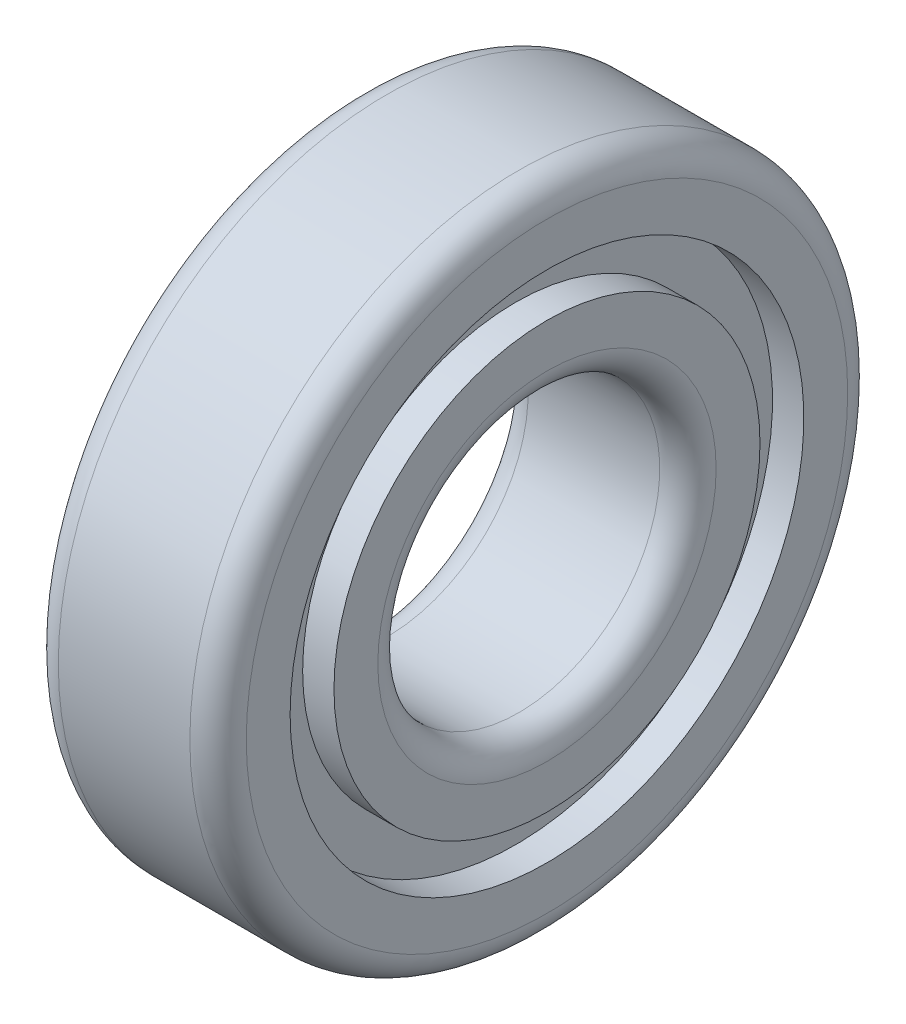
ISO-10303-21;
HEADER;
FILE_DESCRIPTION(('STEP AP214'),'2;1');
FILE_NAME('part.step','',(''),(''),'','','');
FILE_SCHEMA(('AUTOMOTIVE_DESIGN { 1 0 10303 214 1 1 1 1 }'));
ENDSEC;
DATA;
#1=APPLICATION_CONTEXT('core data for automotive mechanical design processes');
#2=APPLICATION_PROTOCOL_DEFINITION('international standard','automotive_design',2000,#1);
#3=PRODUCT_CONTEXT('',#1,'mechanical');
#4=PRODUCT('Part','Part','',(#3));
#5=PRODUCT_RELATED_PRODUCT_CATEGORY('part','',(#4));
#6=PRODUCT_DEFINITION_FORMATION('','',#4);
#7=PRODUCT_DEFINITION_CONTEXT('part definition',#1,'design');
#8=PRODUCT_DEFINITION('design','',#6,#7);
#9=PRODUCT_DEFINITION_SHAPE('','',#8);
#10=(LENGTH_UNIT() NAMED_UNIT(*) SI_UNIT(.MILLI.,.METRE.));
#11=(NAMED_UNIT(*) PLANE_ANGLE_UNIT() SI_UNIT($,.RADIAN.));
#12=(NAMED_UNIT(*) SI_UNIT($,.STERADIAN.) SOLID_ANGLE_UNIT());
#13=UNCERTAINTY_MEASURE_WITH_UNIT(LENGTH_MEASURE(1.E-05),#10,'distance_accuracy_value','');
#14=(GEOMETRIC_REPRESENTATION_CONTEXT(3) GLOBAL_UNCERTAINTY_ASSIGNED_CONTEXT((#13)) GLOBAL_UNIT_ASSIGNED_CONTEXT((#10,
#11,#12)) REPRESENTATION_CONTEXT('',''));
#15=CARTESIAN_POINT('',(0.,0.,0.));
#16=DIRECTION('',(0.,0.,1.));
#17=DIRECTION('',(1.,0.,0.));
#18=AXIS2_PLACEMENT_3D('',#15,#16,#17);
#19=CARTESIAN_POINT('',(-0.700000000000003,0.,0.));
#20=DIRECTION('',(-1.,0.,0.));
#21=DIRECTION('',(0.,0.,1.));
#22=AXIS2_PLACEMENT_3D('',#19,#20,#21);
#23=TOROIDAL_SURFACE('',#22,1.8,0.299999999999996);
#24=CARTESIAN_POINT('',(-0.700000000000034,0.,0.));
#25=DIRECTION('',(-1.,0.,0.));
#26=DIRECTION('',(0.,0.,1.));
#27=AXIS2_PLACEMENT_3D('',#24,#25,#26);
#28=CIRCLE('',#27,1.5);
#29=CARTESIAN_POINT('',(-0.700000000000034,0.,1.5));
#30=VERTEX_POINT('',#29);
#31=EDGE_CURVE('E83',#30,#30,#28,.T.);
#32=ORIENTED_EDGE('',*,*,#31,.F.);
#33=EDGE_LOOP('',(#32));
#34=FACE_BOUND('',#33,.T.);
#35=CARTESIAN_POINT('',(-1.,0.,0.));
#36=DIRECTION('',(-1.,0.,0.));
#37=DIRECTION('',(0.,0.,1.));
#38=AXIS2_PLACEMENT_3D('',#35,#36,#37);
#39=CIRCLE('',#38,1.8);
#40=CARTESIAN_POINT('',(-1.,0.,1.8));
#41=VERTEX_POINT('',#40);
#42=EDGE_CURVE('E10',#41,#41,#39,.T.);
#43=ORIENTED_EDGE('',*,*,#42,.T.);
#44=EDGE_LOOP('',(#43));
#45=FACE_BOUND('',#44,.T.);
#46=ADVANCED_FACE('F31',(#34,#45),#23,.T.);
#47=CARTESIAN_POINT('',(-1.,1.8,0.));
#48=DIRECTION('',(1.,0.,0.));
#49=DIRECTION('',(0.,0.,-1.));
#50=AXIS2_PLACEMENT_3D('',#47,#48,#49);
#51=PLANE('',#50);
#52=ORIENTED_EDGE('',*,*,#42,.F.);
#53=EDGE_LOOP('',(#52));
#54=FACE_BOUND('',#53,.T.);
#55=CARTESIAN_POINT('',(-1.,0.,0.));
#56=DIRECTION('',(-1.,0.,0.));
#57=DIRECTION('',(0.,0.,1.));
#58=AXIS2_PLACEMENT_3D('',#55,#56,#57);
#59=CIRCLE('',#58,2.26666666666667);
#60=CARTESIAN_POINT('',(-1.,0.,2.26666666666667));
#61=VERTEX_POINT('',#60);
#62=EDGE_CURVE('E37',#61,#61,#59,.T.);
#63=ORIENTED_EDGE('',*,*,#62,.T.);
#64=EDGE_LOOP('',(#63));
#65=FACE_BOUND('',#64,.T.);
#66=ADVANCED_FACE('F90',(#54,#65),#51,.F.);
#67=CARTESIAN_POINT('',(-1000.,0.,0.));
#68=DIRECTION('',(-1.,0.,0.));
#69=DIRECTION('',(0.,0.,1.));
#70=AXIS2_PLACEMENT_3D('',#67,#68,#69);
#71=CYLINDRICAL_SURFACE('',#70,2.26666666666667);
#72=ORIENTED_EDGE('',*,*,#62,.F.);
#73=EDGE_LOOP('',(#72));
#74=FACE_BOUND('',#73,.T.);
#75=CARTESIAN_POINT('',(-0.666666666666704,0.,0.));
#76=DIRECTION('',(-1.,0.,0.));
#77=DIRECTION('',(0.,0.,1.));
#78=AXIS2_PLACEMENT_3D('',#75,#76,#77);
#79=CIRCLE('',#78,2.26666666666667);
#80=CARTESIAN_POINT('',(-0.666666666666704,0.,2.26666666666667));
#81=VERTEX_POINT('',#80);
#82=EDGE_CURVE('E41',#81,#81,#79,.T.);
#83=ORIENTED_EDGE('',*,*,#82,.T.);
#84=EDGE_LOOP('',(#83));
#85=FACE_BOUND('',#84,.T.);
#86=ADVANCED_FACE('F94',(#74,#85),#71,.T.);
#87=CARTESIAN_POINT('',(-0.666666666666668,2.26666666666667,0.));
#88=DIRECTION('',(1.,0.,0.));
#89=DIRECTION('',(0.,0.,-1.));
#90=AXIS2_PLACEMENT_3D('',#87,#88,#89);
#91=PLANE('',#90);
#92=ORIENTED_EDGE('',*,*,#82,.F.);
#93=EDGE_LOOP('',(#92));
#94=FACE_BOUND('',#93,.T.);
#95=CARTESIAN_POINT('',(-0.666666666666704,0.,0.));
#96=DIRECTION('',(-1.,0.,0.));
#97=DIRECTION('',(0.,0.,1.));
#98=AXIS2_PLACEMENT_3D('',#95,#96,#97);
#99=CIRCLE('',#98,2.73333333333334);
#100=CARTESIAN_POINT('',(-0.666666666666704,0.,2.73333333333334));
#101=VERTEX_POINT('',#100);
#102=EDGE_CURVE('E45',#101,#101,#99,.T.);
#103=ORIENTED_EDGE('',*,*,#102,.T.);
#104=EDGE_LOOP('',(#103));
#105=FACE_BOUND('',#104,.T.);
#106=ADVANCED_FACE('F99',(#94,#105),#91,.F.);
#107=CARTESIAN_POINT('',(-1000.,0.,0.));
#108=DIRECTION('',(-1.,0.,0.));
#109=DIRECTION('',(0.,0.,1.));
#110=AXIS2_PLACEMENT_3D('',#107,#108,#109);
#111=CYLINDRICAL_SURFACE('',#110,2.73333333333334);
#112=ORIENTED_EDGE('',*,*,#102,.F.);
#113=EDGE_LOOP('',(#112));
#114=FACE_BOUND('',#113,.T.);
#115=CARTESIAN_POINT('',(-1.,0.,0.));
#116=DIRECTION('',(-1.,0.,0.));
#117=DIRECTION('',(0.,0.,1.));
#118=AXIS2_PLACEMENT_3D('',#115,#116,#117);
#119=CIRCLE('',#118,2.73333333333334);
#120=CARTESIAN_POINT('',(-1.,0.,2.73333333333334));
#121=VERTEX_POINT('',#120);
#122=EDGE_CURVE('E50',#121,#121,#119,.T.);
#123=ORIENTED_EDGE('',*,*,#122,.T.);
#124=EDGE_LOOP('',(#123));
#125=FACE_BOUND('',#124,.T.);
#126=ADVANCED_FACE('F105',(#114,#125),#111,.F.);
#127=CARTESIAN_POINT('',(-0.999999999999999,2.73333333333334,0.));
#128=DIRECTION('',(1.,0.,0.));
#129=DIRECTION('',(0.,0.,-1.));
#130=AXIS2_PLACEMENT_3D('',#127,#128,#129);
#131=PLANE('',#130);
#132=ORIENTED_EDGE('',*,*,#122,.F.);
#133=EDGE_LOOP('',(#132));
#134=FACE_BOUND('',#133,.T.);
#135=CARTESIAN_POINT('',(-1.,0.,0.));
#136=DIRECTION('',(-1.,0.,0.));
#137=DIRECTION('',(0.,0.,1.));
#138=AXIS2_PLACEMENT_3D('',#135,#136,#137);
#139=CIRCLE('',#138,3.19999999999999);
#140=CARTESIAN_POINT('',(-1.,0.,3.19999999999999));
#141=VERTEX_POINT('',#140);
#142=EDGE_CURVE('E53',#141,#141,#139,.T.);
#143=ORIENTED_EDGE('',*,*,#142,.T.);
#144=EDGE_LOOP('',(#143));
#145=FACE_BOUND('',#144,.T.);
#146=ADVANCED_FACE('F109',(#134,#145),#131,.F.);
#147=CARTESIAN_POINT('',(-0.699999999999999,0.,0.));
#148=DIRECTION('',(-1.,0.,0.));
#149=DIRECTION('',(0.,0.,1.));
#150=AXIS2_PLACEMENT_3D('',#147,#148,#149);
#151=TOROIDAL_SURFACE('',#150,3.20000000000001,0.299999999999998);
#152=ORIENTED_EDGE('',*,*,#142,.F.);
#153=EDGE_LOOP('',(#152));
#154=FACE_BOUND('',#153,.T.);
#155=CARTESIAN_POINT('',(-0.700000000000034,0.,0.));
#156=DIRECTION('',(-1.,0.,0.));
#157=DIRECTION('',(0.,0.,1.));
#158=AXIS2_PLACEMENT_3D('',#155,#156,#157);
#159=CIRCLE('',#158,3.5);
#160=CARTESIAN_POINT('',(-0.700000000000034,0.,3.5));
#161=VERTEX_POINT('',#160);
#162=EDGE_CURVE('E56',#161,#161,#159,.T.);
#163=ORIENTED_EDGE('',*,*,#162,.T.);
#164=EDGE_LOOP('',(#163));
#165=FACE_BOUND('',#164,.T.);
#166=ADVANCED_FACE('F113',(#154,#165),#151,.T.);
#167=CARTESIAN_POINT('',(-1000.,0.,0.));
#168=DIRECTION('',(-1.,0.,0.));
#169=DIRECTION('',(0.,0.,1.));
#170=AXIS2_PLACEMENT_3D('',#167,#168,#169);
#171=CYLINDRICAL_SURFACE('',#170,3.5);
#172=ORIENTED_EDGE('',*,*,#162,.F.);
#173=EDGE_LOOP('',(#172));
#174=FACE_BOUND('',#173,.T.);
#175=CARTESIAN_POINT('',(0.699999999999923,0.,0.));
#176=DIRECTION('',(-1.,0.,0.));
#177=DIRECTION('',(0.,0.,1.));
#178=AXIS2_PLACEMENT_3D('',#175,#176,#177);
#179=CIRCLE('',#178,3.50000000000001);
#180=CARTESIAN_POINT('',(0.699999999999923,0.,3.50000000000001));
#181=VERTEX_POINT('',#180);
#182=EDGE_CURVE('E59',#181,#181,#179,.T.);
#183=ORIENTED_EDGE('',*,*,#182,.T.);
#184=EDGE_LOOP('',(#183));
#185=FACE_BOUND('',#184,.T.);
#186=ADVANCED_FACE('F117',(#174,#185),#171,.T.);
#187=CARTESIAN_POINT('',(0.699999999999999,0.,0.));
#188=DIRECTION('',(-1.,0.,0.));
#189=DIRECTION('',(0.,0.,1.));
#190=AXIS2_PLACEMENT_3D('',#187,#188,#189);
#191=TOROIDAL_SURFACE('',#190,3.20000000000001,0.299999999999998);
#192=ORIENTED_EDGE('',*,*,#182,.F.);
#193=EDGE_LOOP('',(#192));
#194=FACE_BOUND('',#193,.T.);
#195=CARTESIAN_POINT('',(0.99999999999989,0.,0.));
#196=DIRECTION('',(-1.,0.,0.));
#197=DIRECTION('',(0.,0.,1.));
#198=AXIS2_PLACEMENT_3D('',#195,#196,#197);
#199=CIRCLE('',#198,3.19999999999999);
#200=CARTESIAN_POINT('',(0.99999999999989,0.,3.19999999999999));
#201=VERTEX_POINT('',#200);
#202=EDGE_CURVE('E62',#201,#201,#199,.T.);
#203=ORIENTED_EDGE('',*,*,#202,.T.);
#204=EDGE_LOOP('',(#203));
#205=FACE_BOUND('',#204,.T.);
#206=ADVANCED_FACE('F121',(#194,#205),#191,.T.);
#207=CARTESIAN_POINT('',(1.,2.73333333333334,0.));
#208=DIRECTION('',(-1.,0.,0.));
#209=DIRECTION('',(0.,0.,1.));
#210=AXIS2_PLACEMENT_3D('',#207,#208,#209);
#211=PLANE('',#210);
#212=ORIENTED_EDGE('',*,*,#202,.F.);
#213=EDGE_LOOP('',(#212));
#214=FACE_BOUND('',#213,.T.);
#215=CARTESIAN_POINT('',(0.99999999999989,0.,0.));
#216=DIRECTION('',(-1.,0.,0.));
#217=DIRECTION('',(0.,0.,1.));
#218=AXIS2_PLACEMENT_3D('',#215,#216,#217);
#219=CIRCLE('',#218,2.73333333333334);
#220=CARTESIAN_POINT('',(0.99999999999989,0.,2.73333333333334));
#221=VERTEX_POINT('',#220);
#222=EDGE_CURVE('E65',#221,#221,#219,.T.);
#223=ORIENTED_EDGE('',*,*,#222,.T.);
#224=EDGE_LOOP('',(#223));
#225=FACE_BOUND('',#224,.T.);
#226=ADVANCED_FACE('F125',(#214,#225),#211,.F.);
#227=CARTESIAN_POINT('',(-1000.,0.,0.));
#228=DIRECTION('',(-1.,0.,0.));
#229=DIRECTION('',(0.,0.,1.));
#230=AXIS2_PLACEMENT_3D('',#227,#228,#229);
#231=CYLINDRICAL_SURFACE('',#230,2.73333333333334);
#232=ORIENTED_EDGE('',*,*,#222,.F.);
#233=EDGE_LOOP('',(#232));
#234=FACE_BOUND('',#233,.T.);
#235=CARTESIAN_POINT('',(0.666666666666593,0.,0.));
#236=DIRECTION('',(-1.,0.,0.));
#237=DIRECTION('',(0.,0.,1.));
#238=AXIS2_PLACEMENT_3D('',#235,#236,#237);
#239=CIRCLE('',#238,2.73333333333334);
#240=CARTESIAN_POINT('',(0.666666666666593,0.,2.73333333333334));
#241=VERTEX_POINT('',#240);
#242=EDGE_CURVE('E68',#241,#241,#239,.T.);
#243=ORIENTED_EDGE('',*,*,#242,.T.);
#244=EDGE_LOOP('',(#243));
#245=FACE_BOUND('',#244,.T.);
#246=ADVANCED_FACE('F129',(#234,#245),#231,.F.);
#247=CARTESIAN_POINT('',(0.666666666666668,2.26666666666667,0.));
#248=DIRECTION('',(-1.,0.,0.));
#249=DIRECTION('',(0.,0.,1.));
#250=AXIS2_PLACEMENT_3D('',#247,#248,#249);
#251=PLANE('',#250);
#252=ORIENTED_EDGE('',*,*,#242,.F.);
#253=EDGE_LOOP('',(#252));
#254=FACE_BOUND('',#253,.T.);
#255=CARTESIAN_POINT('',(0.666666666666593,0.,0.));
#256=DIRECTION('',(-1.,0.,0.));
#257=DIRECTION('',(0.,0.,1.));
#258=AXIS2_PLACEMENT_3D('',#255,#256,#257);
#259=CIRCLE('',#258,2.26666666666667);
#260=CARTESIAN_POINT('',(0.666666666666593,0.,2.26666666666667));
#261=VERTEX_POINT('',#260);
#262=EDGE_CURVE('E71',#261,#261,#259,.T.);
#263=ORIENTED_EDGE('',*,*,#262,.T.);
#264=EDGE_LOOP('',(#263));
#265=FACE_BOUND('',#264,.T.);
#266=ADVANCED_FACE('F133',(#254,#265),#251,.F.);
#267=CARTESIAN_POINT('',(-1000.,0.,0.));
#268=DIRECTION('',(-1.,0.,0.));
#269=DIRECTION('',(0.,0.,1.));
#270=AXIS2_PLACEMENT_3D('',#267,#268,#269);
#271=CYLINDRICAL_SURFACE('',#270,2.26666666666667);
#272=ORIENTED_EDGE('',*,*,#262,.F.);
#273=EDGE_LOOP('',(#272));
#274=FACE_BOUND('',#273,.T.);
#275=CARTESIAN_POINT('',(0.99999999999989,0.,0.));
#276=DIRECTION('',(-1.,0.,0.));
#277=DIRECTION('',(0.,0.,1.));
#278=AXIS2_PLACEMENT_3D('',#275,#276,#277);
#279=CIRCLE('',#278,2.26666666666667);
#280=CARTESIAN_POINT('',(0.99999999999989,0.,2.26666666666667));
#281=VERTEX_POINT('',#280);
#282=EDGE_CURVE('E74',#281,#281,#279,.T.);
#283=ORIENTED_EDGE('',*,*,#282,.T.);
#284=EDGE_LOOP('',(#283));
#285=FACE_BOUND('',#284,.T.);
#286=ADVANCED_FACE('F137',(#274,#285),#271,.T.);
#287=CARTESIAN_POINT('',(1.,1.8,0.));
#288=DIRECTION('',(-1.,0.,0.));
#289=DIRECTION('',(0.,0.,1.));
#290=AXIS2_PLACEMENT_3D('',#287,#288,#289);
#291=PLANE('',#290);
#292=ORIENTED_EDGE('',*,*,#282,.F.);
#293=EDGE_LOOP('',(#292));
#294=FACE_BOUND('',#293,.T.);
#295=CARTESIAN_POINT('',(0.99999999999989,0.,0.));
#296=DIRECTION('',(-1.,0.,0.));
#297=DIRECTION('',(0.,0.,1.));
#298=AXIS2_PLACEMENT_3D('',#295,#296,#297);
#299=CIRCLE('',#298,1.8);
#300=CARTESIAN_POINT('',(0.99999999999989,0.,1.8));
#301=VERTEX_POINT('',#300);
#302=EDGE_CURVE('E77',#301,#301,#299,.T.);
#303=ORIENTED_EDGE('',*,*,#302,.T.);
#304=EDGE_LOOP('',(#303));
#305=FACE_BOUND('',#304,.T.);
#306=ADVANCED_FACE('F141',(#294,#305),#291,.F.);
#307=CARTESIAN_POINT('',(0.700000000000003,0.,0.));
#308=DIRECTION('',(-1.,0.,0.));
#309=DIRECTION('',(0.,0.,1.));
#310=AXIS2_PLACEMENT_3D('',#307,#308,#309);
#311=TOROIDAL_SURFACE('',#310,1.8,0.299999999999996);
#312=ORIENTED_EDGE('',*,*,#302,.F.);
#313=EDGE_LOOP('',(#312));
#314=FACE_BOUND('',#313,.T.);
#315=CARTESIAN_POINT('',(0.699999999999923,0.,0.));
#316=DIRECTION('',(-1.,0.,0.));
#317=DIRECTION('',(0.,0.,1.));
#318=AXIS2_PLACEMENT_3D('',#315,#316,#317);
#319=CIRCLE('',#318,1.5);
#320=CARTESIAN_POINT('',(0.699999999999923,0.,1.5));
#321=VERTEX_POINT('',#320);
#322=EDGE_CURVE('E80',#321,#321,#319,.T.);
#323=ORIENTED_EDGE('',*,*,#322,.T.);
#324=EDGE_LOOP('',(#323));
#325=FACE_BOUND('',#324,.T.);
#326=ADVANCED_FACE('F145',(#314,#325),#311,.T.);
#327=CARTESIAN_POINT('',(-1000.,0.,0.));
#328=DIRECTION('',(-1.,0.,0.));
#329=DIRECTION('',(0.,0.,1.));
#330=AXIS2_PLACEMENT_3D('',#327,#328,#329);
#331=CYLINDRICAL_SURFACE('',#330,1.5);
#332=ORIENTED_EDGE('',*,*,#322,.F.);
#333=EDGE_LOOP('',(#332));
#334=FACE_BOUND('',#333,.T.);
#335=ORIENTED_EDGE('',*,*,#31,.T.);
#336=EDGE_LOOP('',(#335));
#337=FACE_BOUND('',#336,.T.);
#338=ADVANCED_FACE('F87',(#334,#337),#331,.F.);
#339=CLOSED_SHELL('',(#46,#66,#86,#106,#126,#146,#166,#186,#206,#226,#246,#266,#286,#306,#326,#338));
#340=MANIFOLD_SOLID_BREP('B2',#339);
#341=ADVANCED_BREP_SHAPE_REPRESENTATION('',(#18,#340),#14);
#342=SHAPE_DEFINITION_REPRESENTATION(#9,#341);
ENDSEC;
END-ISO-10303-21;
